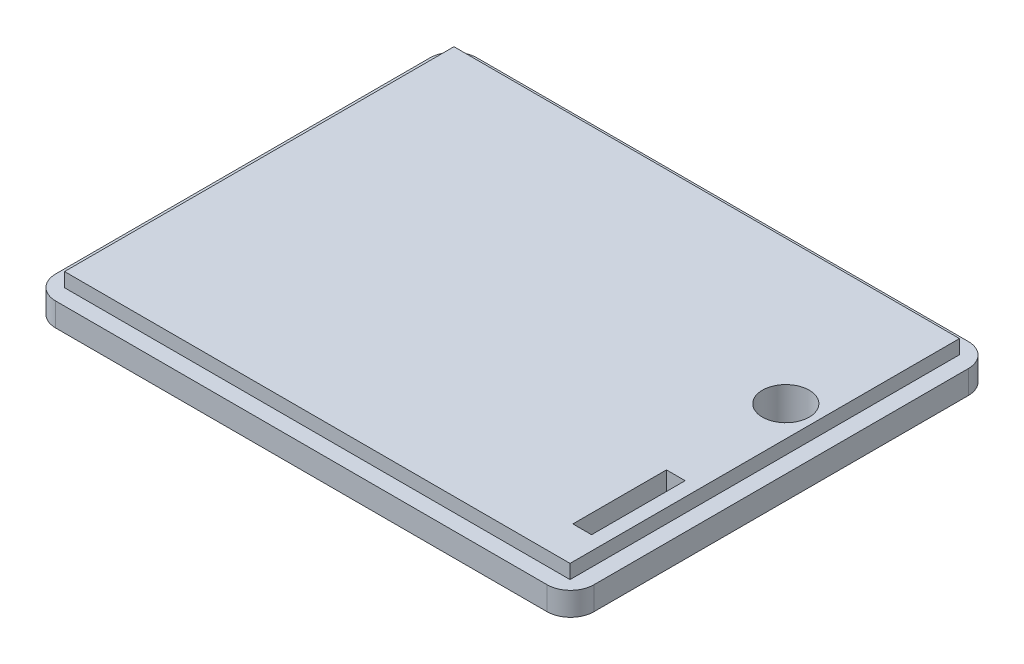
ISO-10303-21;
HEADER;
FILE_DESCRIPTION(('STEP AP214'),'2;1');
FILE_NAME('part.step','',(''),(''),'','','');
FILE_SCHEMA(('AUTOMOTIVE_DESIGN { 1 0 10303 214 1 1 1 1 }'));
ENDSEC;
DATA;
#1=APPLICATION_CONTEXT('core data for automotive mechanical design processes');
#2=APPLICATION_PROTOCOL_DEFINITION('international standard','automotive_design',2000,#1);
#3=PRODUCT_CONTEXT('',#1,'mechanical');
#4=PRODUCT('Part','Part','',(#3));
#5=PRODUCT_RELATED_PRODUCT_CATEGORY('part','',(#4));
#6=PRODUCT_DEFINITION_FORMATION('','',#4);
#7=PRODUCT_DEFINITION_CONTEXT('part definition',#1,'design');
#8=PRODUCT_DEFINITION('design','',#6,#7);
#9=PRODUCT_DEFINITION_SHAPE('','',#8);
#10=(LENGTH_UNIT() NAMED_UNIT(*) SI_UNIT(.MILLI.,.METRE.));
#11=(NAMED_UNIT(*) PLANE_ANGLE_UNIT() SI_UNIT($,.RADIAN.));
#12=(NAMED_UNIT(*) SI_UNIT($,.STERADIAN.) SOLID_ANGLE_UNIT());
#13=UNCERTAINTY_MEASURE_WITH_UNIT(LENGTH_MEASURE(1.E-05),#10,'distance_accuracy_value','');
#14=(GEOMETRIC_REPRESENTATION_CONTEXT(3) GLOBAL_UNCERTAINTY_ASSIGNED_CONTEXT((#13)) GLOBAL_UNIT_ASSIGNED_CONTEXT((#10,
#11,#12)) REPRESENTATION_CONTEXT('',''));
#15=CARTESIAN_POINT('',(0.,0.,0.));
#16=DIRECTION('',(0.,0.,1.));
#17=DIRECTION('',(1.,0.,0.));
#18=AXIS2_PLACEMENT_3D('',#15,#16,#17);
#19=CARTESIAN_POINT('',(57.5,5.,-45.));
#20=DIRECTION('',(-1.,0.,0.));
#21=DIRECTION('',(0.,0.,1.));
#22=AXIS2_PLACEMENT_3D('',#19,#20,#21);
#23=PLANE('',#22);
#24=DIRECTION('',(0.,0.,-1.));
#25=VECTOR('',#24,1.);
#26=CARTESIAN_POINT('',(57.5,0.,-45.));
#27=LINE('',#26,#25);
#28=CARTESIAN_POINT('',(57.5,0.,40.));
#29=VERTEX_POINT('',#28);
#30=CARTESIAN_POINT('',(57.5,0.,-40.));
#31=VERTEX_POINT('',#30);
#32=EDGE_CURVE('E326',#29,#31,#27,.T.);
#33=ORIENTED_EDGE('',*,*,#32,.T.);
#34=DIRECTION('',(0.,-1.,0.));
#35=VECTOR('',#34,1.);
#36=CARTESIAN_POINT('',(57.5,5.,-40.));
#37=LINE('',#36,#35);
#38=CARTESIAN_POINT('',(57.5,5.,-40.));
#39=VERTEX_POINT('',#38);
#40=EDGE_CURVE('E378',#31,#39,#37,.F.);
#41=ORIENTED_EDGE('',*,*,#40,.T.);
#42=DIRECTION('',(0.,0.,-1.));
#43=VECTOR('',#42,1.);
#44=CARTESIAN_POINT('',(57.5,5.,-45.));
#45=LINE('',#44,#43);
#46=CARTESIAN_POINT('',(57.5,5.,40.));
#47=VERTEX_POINT('',#46);
#48=EDGE_CURVE('E327',#47,#39,#45,.T.);
#49=ORIENTED_EDGE('',*,*,#48,.F.);
#50=DIRECTION('',(0.,-1.,0.));
#51=VECTOR('',#50,1.);
#52=CARTESIAN_POINT('',(57.5,5.,40.));
#53=LINE('',#52,#51);
#54=EDGE_CURVE('E375',#47,#29,#53,.T.);
#55=ORIENTED_EDGE('',*,*,#54,.T.);
#56=EDGE_LOOP('',(#33,#41,#49,#55));
#57=FACE_BOUND('',#56,.T.);
#58=ADVANCED_FACE('F33',(#57),#23,.F.);
#59=CARTESIAN_POINT('',(-57.5,5.,-45.));
#60=DIRECTION('',(0.,0.,1.));
#61=DIRECTION('',(1.,0.,0.));
#62=AXIS2_PLACEMENT_3D('',#59,#60,#61);
#63=PLANE('',#62);
#64=DIRECTION('',(-1.,0.,0.));
#65=VECTOR('',#64,1.);
#66=CARTESIAN_POINT('',(-57.5,0.,-45.));
#67=LINE('',#66,#65);
#68=CARTESIAN_POINT('',(52.5,0.,-45.));
#69=VERTEX_POINT('',#68);
#70=CARTESIAN_POINT('',(-52.5,0.,-45.));
#71=VERTEX_POINT('',#70);
#72=EDGE_CURVE('E342',#69,#71,#67,.T.);
#73=ORIENTED_EDGE('',*,*,#72,.T.);
#74=DIRECTION('',(0.,-1.,0.));
#75=VECTOR('',#74,1.);
#76=CARTESIAN_POINT('',(-52.5,5.,-45.));
#77=LINE('',#76,#75);
#78=CARTESIAN_POINT('',(-52.5,5.,-45.));
#79=VERTEX_POINT('',#78);
#80=EDGE_CURVE('E365',#71,#79,#77,.F.);
#81=ORIENTED_EDGE('',*,*,#80,.T.);
#82=DIRECTION('',(-1.,0.,0.));
#83=VECTOR('',#82,1.);
#84=CARTESIAN_POINT('',(-57.5,5.,-45.));
#85=LINE('',#84,#83);
#86=CARTESIAN_POINT('',(52.5,5.,-45.));
#87=VERTEX_POINT('',#86);
#88=EDGE_CURVE('E330',#87,#79,#85,.T.);
#89=ORIENTED_EDGE('',*,*,#88,.F.);
#90=DIRECTION('',(0.,-1.,0.));
#91=VECTOR('',#90,1.);
#92=CARTESIAN_POINT('',(52.5,5.,-45.));
#93=LINE('',#92,#91);
#94=EDGE_CURVE('E362',#87,#69,#93,.T.);
#95=ORIENTED_EDGE('',*,*,#94,.T.);
#96=EDGE_LOOP('',(#73,#81,#89,#95));
#97=FACE_BOUND('',#96,.T.);
#98=ADVANCED_FACE('F230',(#97),#63,.F.);
#99=CARTESIAN_POINT('',(-57.5,5.,-45.));
#100=DIRECTION('',(1.,0.,0.));
#101=DIRECTION('',(0.,0.,-1.));
#102=AXIS2_PLACEMENT_3D('',#99,#100,#101);
#103=PLANE('',#102);
#104=DIRECTION('',(0.,0.,1.));
#105=VECTOR('',#104,1.);
#106=CARTESIAN_POINT('',(-57.5,5.,-45.));
#107=LINE('',#106,#105);
#108=CARTESIAN_POINT('',(-57.5,5.,-40.));
#109=VERTEX_POINT('',#108);
#110=CARTESIAN_POINT('',(-57.5,5.,40.));
#111=VERTEX_POINT('',#110);
#112=EDGE_CURVE('E334',#109,#111,#107,.T.);
#113=ORIENTED_EDGE('',*,*,#112,.F.);
#114=DIRECTION('',(0.,-1.,0.));
#115=VECTOR('',#114,1.);
#116=CARTESIAN_POINT('',(-57.5,5.,-40.));
#117=LINE('',#116,#115);
#118=CARTESIAN_POINT('',(-57.5,0.,-40.));
#119=VERTEX_POINT('',#118);
#120=EDGE_CURVE('E351',#109,#119,#117,.T.);
#121=ORIENTED_EDGE('',*,*,#120,.T.);
#122=DIRECTION('',(0.,0.,1.));
#123=VECTOR('',#122,1.);
#124=CARTESIAN_POINT('',(-57.5,0.,-45.));
#125=LINE('',#124,#123);
#126=CARTESIAN_POINT('',(-57.5,0.,40.));
#127=VERTEX_POINT('',#126);
#128=EDGE_CURVE('E345',#119,#127,#125,.T.);
#129=ORIENTED_EDGE('',*,*,#128,.T.);
#130=DIRECTION('',(0.,-1.,0.));
#131=VECTOR('',#130,1.);
#132=CARTESIAN_POINT('',(-57.5,5.,40.));
#133=LINE('',#132,#131);
#134=EDGE_CURVE('E340',#127,#111,#133,.F.);
#135=ORIENTED_EDGE('',*,*,#134,.T.);
#136=EDGE_LOOP('',(#113,#121,#129,#135));
#137=FACE_BOUND('',#136,.T.);
#138=ADVANCED_FACE('F236',(#137),#103,.F.);
#139=CARTESIAN_POINT('',(-57.5,5.,45.));
#140=DIRECTION('',(0.,0.,-1.));
#141=DIRECTION('',(-1.,0.,0.));
#142=AXIS2_PLACEMENT_3D('',#139,#140,#141);
#143=PLANE('',#142);
#144=DIRECTION('',(1.,0.,0.));
#145=VECTOR('',#144,1.);
#146=CARTESIAN_POINT('',(-57.5,0.,45.));
#147=LINE('',#146,#145);
#148=CARTESIAN_POINT('',(-52.5,0.,45.));
#149=VERTEX_POINT('',#148);
#150=CARTESIAN_POINT('',(52.5,0.,45.));
#151=VERTEX_POINT('',#150);
#152=EDGE_CURVE('E331',#149,#151,#147,.T.);
#153=ORIENTED_EDGE('',*,*,#152,.T.);
#154=DIRECTION('',(0.,-1.,0.));
#155=VECTOR('',#154,1.);
#156=CARTESIAN_POINT('',(52.5,5.,45.));
#157=LINE('',#156,#155);
#158=CARTESIAN_POINT('',(52.5,5.,45.));
#159=VERTEX_POINT('',#158);
#160=EDGE_CURVE('E173',#151,#159,#157,.F.);
#161=ORIENTED_EDGE('',*,*,#160,.T.);
#162=DIRECTION('',(1.,0.,0.));
#163=VECTOR('',#162,1.);
#164=CARTESIAN_POINT('',(-57.5,5.,45.));
#165=LINE('',#164,#163);
#166=CARTESIAN_POINT('',(-52.5,5.,45.));
#167=VERTEX_POINT('',#166);
#168=EDGE_CURVE('E337',#167,#159,#165,.T.);
#169=ORIENTED_EDGE('',*,*,#168,.F.);
#170=DIRECTION('',(0.,-1.,0.));
#171=VECTOR('',#170,1.);
#172=CARTESIAN_POINT('',(-52.5,5.,45.));
#173=LINE('',#172,#171);
#174=EDGE_CURVE('E380',#167,#149,#173,.T.);
#175=ORIENTED_EDGE('',*,*,#174,.T.);
#176=EDGE_LOOP('',(#153,#161,#169,#175));
#177=FACE_BOUND('',#176,.T.);
#178=ADVANCED_FACE('F386',(#177),#143,.F.);
#179=CARTESIAN_POINT('',(0.,5.,0.));
#180=DIRECTION('',(0.,1.,0.));
#181=DIRECTION('',(0.,0.,1.));
#182=AXIS2_PLACEMENT_3D('',#179,#180,#181);
#183=PLANE('',#182);
#184=DIRECTION('',(0.,0.,-1.));
#185=VECTOR('',#184,1.);
#186=CARTESIAN_POINT('',(54.,5.,-41.6));
#187=LINE('',#186,#185);
#188=CARTESIAN_POINT('',(54.,5.,41.6));
#189=VERTEX_POINT('',#188);
#190=CARTESIAN_POINT('',(54.,5.,-41.6));
#191=VERTEX_POINT('',#190);
#192=EDGE_CURVE('E304',#189,#191,#187,.T.);
#193=ORIENTED_EDGE('',*,*,#192,.F.);
#194=DIRECTION('',(1.,0.,0.));
#195=VECTOR('',#194,1.);
#196=CARTESIAN_POINT('',(-54.,5.,41.6));
#197=LINE('',#196,#195);
#198=CARTESIAN_POINT('',(-54.,5.,41.6));
#199=VERTEX_POINT('',#198);
#200=EDGE_CURVE('E297',#199,#189,#197,.T.);
#201=ORIENTED_EDGE('',*,*,#200,.F.);
#202=DIRECTION('',(0.,0.,1.));
#203=VECTOR('',#202,1.);
#204=CARTESIAN_POINT('',(-54.,5.,-41.6));
#205=LINE('',#204,#203);
#206=CARTESIAN_POINT('',(-54.,5.,-41.6));
#207=VERTEX_POINT('',#206);
#208=EDGE_CURVE('E310',#207,#199,#205,.T.);
#209=ORIENTED_EDGE('',*,*,#208,.F.);
#210=DIRECTION('',(-1.,0.,0.));
#211=VECTOR('',#210,1.);
#212=CARTESIAN_POINT('',(-54.,5.,-41.6));
#213=LINE('',#212,#211);
#214=EDGE_CURVE('E307',#191,#207,#213,.T.);
#215=ORIENTED_EDGE('',*,*,#214,.F.);
#216=EDGE_LOOP('',(#193,#201,#209,#215));
#217=FACE_BOUND('',#216,.T.);
#218=ORIENTED_EDGE('',*,*,#88,.T.);
#219=CARTESIAN_POINT('',(-52.5,5.,-40.));
#220=DIRECTION('',(0.,1.,0.));
#221=DIRECTION('',(0.,0.,1.));
#222=AXIS2_PLACEMENT_3D('',#219,#220,#221);
#223=CIRCLE('',#222,5.);
#224=EDGE_CURVE('E373',#79,#109,#223,.T.);
#225=ORIENTED_EDGE('',*,*,#224,.T.);
#226=ORIENTED_EDGE('',*,*,#112,.T.);
#227=CARTESIAN_POINT('',(-52.5,5.,40.));
#228=DIRECTION('',(0.,1.,0.));
#229=DIRECTION('',(0.,0.,1.));
#230=AXIS2_PLACEMENT_3D('',#227,#228,#229);
#231=CIRCLE('',#230,5.);
#232=EDGE_CURVE('E367',#111,#167,#231,.T.);
#233=ORIENTED_EDGE('',*,*,#232,.T.);
#234=ORIENTED_EDGE('',*,*,#168,.T.);
#235=CARTESIAN_POINT('',(52.5,5.,40.));
#236=DIRECTION('',(0.,1.,0.));
#237=DIRECTION('',(0.,0.,1.));
#238=AXIS2_PLACEMENT_3D('',#235,#236,#237);
#239=CIRCLE('',#238,5.);
#240=EDGE_CURVE('E369',#159,#47,#239,.T.);
#241=ORIENTED_EDGE('',*,*,#240,.T.);
#242=ORIENTED_EDGE('',*,*,#48,.T.);
#243=CARTESIAN_POINT('',(52.5,5.,-40.));
#244=DIRECTION('',(0.,1.,0.));
#245=DIRECTION('',(0.,0.,1.));
#246=AXIS2_PLACEMENT_3D('',#243,#244,#245);
#247=CIRCLE('',#246,5.);
#248=EDGE_CURVE('E371',#39,#87,#247,.T.);
#249=ORIENTED_EDGE('',*,*,#248,.T.);
#250=EDGE_LOOP('',(#218,#225,#226,#233,#234,#241,#242,#249));
#251=FACE_BOUND('',#250,.T.);
#252=ADVANCED_FACE('F391',(#217,#251),#183,.T.);
#253=CARTESIAN_POINT('',(0.,0.,0.));
#254=DIRECTION('',(0.,1.,0.));
#255=DIRECTION('',(0.,0.,1.));
#256=AXIS2_PLACEMENT_3D('',#253,#254,#255);
#257=PLANE('',#256);
#258=CARTESIAN_POINT('',(47.5,0.,-11.));
#259=DIRECTION('',(0.,1.,0.));
#260=DIRECTION('',(0.,0.,1.));
#261=AXIS2_PLACEMENT_3D('',#258,#259,#260);
#262=CIRCLE('',#261,6.);
#263=CARTESIAN_POINT('',(47.5,0.,-5.00000000000001));
#264=VERTEX_POINT('',#263);
#265=EDGE_CURVE('E11',#264,#264,#262,.T.);
#266=ORIENTED_EDGE('',*,*,#265,.T.);
#267=EDGE_LOOP('',(#266));
#268=FACE_BOUND('',#267,.T.);
#269=DIRECTION('',(0.,0.,1.));
#270=VECTOR('',#269,1.);
#271=CARTESIAN_POINT('',(52.,0.,0.));
#272=LINE('',#271,#270);
#273=CARTESIAN_POINT('',(52.,0.,35.));
#274=VERTEX_POINT('',#273);
#275=CARTESIAN_POINT('',(52.,0.,13.));
#276=VERTEX_POINT('',#275);
#277=EDGE_CURVE('E196',#274,#276,#272,.F.);
#278=ORIENTED_EDGE('',*,*,#277,.T.);
#279=DIRECTION('',(1.,0.,0.));
#280=VECTOR('',#279,1.);
#281=CARTESIAN_POINT('',(0.,0.,12.9999999999999));
#282=LINE('',#281,#280);
#283=CARTESIAN_POINT('',(46.,0.,13.));
#284=VERTEX_POINT('',#283);
#285=EDGE_CURVE('E198',#276,#284,#282,.F.);
#286=ORIENTED_EDGE('',*,*,#285,.T.);
#287=DIRECTION('',(0.,0.,-1.));
#288=VECTOR('',#287,1.);
#289=CARTESIAN_POINT('',(46.,0.,0.));
#290=LINE('',#289,#288);
#291=CARTESIAN_POINT('',(46.,0.,35.));
#292=VERTEX_POINT('',#291);
#293=EDGE_CURVE('E194',#284,#292,#290,.F.);
#294=ORIENTED_EDGE('',*,*,#293,.T.);
#295=DIRECTION('',(-1.,0.,0.));
#296=VECTOR('',#295,1.);
#297=CARTESIAN_POINT('',(0.,0.,35.));
#298=LINE('',#297,#296);
#299=EDGE_CURVE('E188',#292,#274,#298,.F.);
#300=ORIENTED_EDGE('',*,*,#299,.T.);
#301=EDGE_LOOP('',(#278,#286,#294,#300));
#302=FACE_BOUND('',#301,.T.);
#303=ORIENTED_EDGE('',*,*,#128,.F.);
#304=CARTESIAN_POINT('',(-52.5,0.,-40.));
#305=DIRECTION('',(0.,1.,0.));
#306=DIRECTION('',(0.,0.,1.));
#307=AXIS2_PLACEMENT_3D('',#304,#305,#306);
#308=CIRCLE('',#307,5.);
#309=EDGE_CURVE('E360',#119,#71,#308,.F.);
#310=ORIENTED_EDGE('',*,*,#309,.T.);
#311=ORIENTED_EDGE('',*,*,#72,.F.);
#312=CARTESIAN_POINT('',(52.5,0.,-40.));
#313=DIRECTION('',(0.,1.,0.));
#314=DIRECTION('',(0.,0.,1.));
#315=AXIS2_PLACEMENT_3D('',#312,#313,#314);
#316=CIRCLE('',#315,5.);
#317=EDGE_CURVE('E358',#69,#31,#316,.F.);
#318=ORIENTED_EDGE('',*,*,#317,.T.);
#319=ORIENTED_EDGE('',*,*,#32,.F.);
#320=CARTESIAN_POINT('',(52.5,0.,40.));
#321=DIRECTION('',(0.,1.,0.));
#322=DIRECTION('',(0.,0.,1.));
#323=AXIS2_PLACEMENT_3D('',#320,#321,#322);
#324=CIRCLE('',#323,5.);
#325=EDGE_CURVE('E356',#29,#151,#324,.F.);
#326=ORIENTED_EDGE('',*,*,#325,.T.);
#327=ORIENTED_EDGE('',*,*,#152,.F.);
#328=CARTESIAN_POINT('',(-52.5,0.,40.));
#329=DIRECTION('',(0.,1.,0.));
#330=DIRECTION('',(0.,0.,1.));
#331=AXIS2_PLACEMENT_3D('',#328,#329,#330);
#332=CIRCLE('',#331,5.);
#333=EDGE_CURVE('E354',#149,#127,#332,.F.);
#334=ORIENTED_EDGE('',*,*,#333,.T.);
#335=EDGE_LOOP('',(#303,#310,#311,#318,#319,#326,#327,#334));
#336=FACE_BOUND('',#335,.T.);
#337=ADVANCED_FACE('F283',(#268,#302,#336),#257,.F.);
#338=CARTESIAN_POINT('',(54.,8.,-41.6));
#339=DIRECTION('',(-1.,0.,0.));
#340=DIRECTION('',(0.,0.,1.));
#341=AXIS2_PLACEMENT_3D('',#338,#339,#340);
#342=PLANE('',#341);
#343=ORIENTED_EDGE('',*,*,#192,.T.);
#344=DIRECTION('',(0.,-1.,0.));
#345=VECTOR('',#344,1.);
#346=CARTESIAN_POINT('',(54.,8.,-41.6));
#347=LINE('',#346,#345);
#348=CARTESIAN_POINT('',(54.,8.,-41.6));
#349=VERTEX_POINT('',#348);
#350=EDGE_CURVE('E323',#349,#191,#347,.T.);
#351=ORIENTED_EDGE('',*,*,#350,.F.);
#352=DIRECTION('',(0.,0.,-1.));
#353=VECTOR('',#352,1.);
#354=CARTESIAN_POINT('',(54.,8.,-41.6));
#355=LINE('',#354,#353);
#356=CARTESIAN_POINT('',(54.,8.,41.6));
#357=VERTEX_POINT('',#356);
#358=EDGE_CURVE('E293',#357,#349,#355,.T.);
#359=ORIENTED_EDGE('',*,*,#358,.F.);
#360=DIRECTION('',(0.,-1.,0.));
#361=VECTOR('',#360,1.);
#362=CARTESIAN_POINT('',(54.,8.,41.6));
#363=LINE('',#362,#361);
#364=EDGE_CURVE('E303',#357,#189,#363,.T.);
#365=ORIENTED_EDGE('',*,*,#364,.T.);
#366=EDGE_LOOP('',(#343,#351,#359,#365));
#367=FACE_BOUND('',#366,.T.);
#368=ADVANCED_FACE('F416',(#367),#342,.F.);
#369=CARTESIAN_POINT('',(-54.,8.,-41.6));
#370=DIRECTION('',(0.,0.,1.));
#371=DIRECTION('',(1.,0.,0.));
#372=AXIS2_PLACEMENT_3D('',#369,#370,#371);
#373=PLANE('',#372);
#374=ORIENTED_EDGE('',*,*,#214,.T.);
#375=DIRECTION('',(0.,-1.,0.));
#376=VECTOR('',#375,1.);
#377=CARTESIAN_POINT('',(-54.,8.,-41.6));
#378=LINE('',#377,#376);
#379=CARTESIAN_POINT('',(-54.,8.,-41.6));
#380=VERTEX_POINT('',#379);
#381=EDGE_CURVE('E320',#380,#207,#378,.T.);
#382=ORIENTED_EDGE('',*,*,#381,.F.);
#383=DIRECTION('',(-1.,0.,0.));
#384=VECTOR('',#383,1.);
#385=CARTESIAN_POINT('',(-54.,8.,-41.6));
#386=LINE('',#385,#384);
#387=EDGE_CURVE('E296',#349,#380,#386,.T.);
#388=ORIENTED_EDGE('',*,*,#387,.F.);
#389=ORIENTED_EDGE('',*,*,#350,.T.);
#390=EDGE_LOOP('',(#374,#382,#388,#389));
#391=FACE_BOUND('',#390,.T.);
#392=ADVANCED_FACE('F423',(#391),#373,.F.);
#393=CARTESIAN_POINT('',(-54.,8.,-41.6));
#394=DIRECTION('',(1.,0.,0.));
#395=DIRECTION('',(0.,0.,-1.));
#396=AXIS2_PLACEMENT_3D('',#393,#394,#395);
#397=PLANE('',#396);
#398=ORIENTED_EDGE('',*,*,#208,.T.);
#399=DIRECTION('',(0.,-1.,0.));
#400=VECTOR('',#399,1.);
#401=CARTESIAN_POINT('',(-54.,8.,41.6));
#402=LINE('',#401,#400);
#403=CARTESIAN_POINT('',(-54.,8.,41.6));
#404=VERTEX_POINT('',#403);
#405=EDGE_CURVE('E317',#404,#199,#402,.T.);
#406=ORIENTED_EDGE('',*,*,#405,.F.);
#407=DIRECTION('',(0.,0.,1.));
#408=VECTOR('',#407,1.);
#409=CARTESIAN_POINT('',(-54.,8.,-41.6));
#410=LINE('',#409,#408);
#411=EDGE_CURVE('E299',#380,#404,#410,.T.);
#412=ORIENTED_EDGE('',*,*,#411,.F.);
#413=ORIENTED_EDGE('',*,*,#381,.T.);
#414=EDGE_LOOP('',(#398,#406,#412,#413));
#415=FACE_BOUND('',#414,.T.);
#416=ADVANCED_FACE('F427',(#415),#397,.F.);
#417=CARTESIAN_POINT('',(-54.,8.,41.6));
#418=DIRECTION('',(0.,0.,-1.));
#419=DIRECTION('',(-1.,0.,0.));
#420=AXIS2_PLACEMENT_3D('',#417,#418,#419);
#421=PLANE('',#420);
#422=ORIENTED_EDGE('',*,*,#200,.T.);
#423=ORIENTED_EDGE('',*,*,#364,.F.);
#424=DIRECTION('',(1.,0.,0.));
#425=VECTOR('',#424,1.);
#426=CARTESIAN_POINT('',(-54.,8.,41.6));
#427=LINE('',#426,#425);
#428=EDGE_CURVE('E301',#404,#357,#427,.T.);
#429=ORIENTED_EDGE('',*,*,#428,.F.);
#430=ORIENTED_EDGE('',*,*,#405,.T.);
#431=EDGE_LOOP('',(#422,#423,#429,#430));
#432=FACE_BOUND('',#431,.T.);
#433=ADVANCED_FACE('F431',(#432),#421,.F.);
#434=CARTESIAN_POINT('',(0.,8.,0.));
#435=DIRECTION('',(0.,1.,0.));
#436=DIRECTION('',(0.,0.,1.));
#437=AXIS2_PLACEMENT_3D('',#434,#435,#436);
#438=PLANE('',#437);
#439=CARTESIAN_POINT('',(47.5,8.,-11.));
#440=DIRECTION('',(0.,1.,0.));
#441=DIRECTION('',(0.,0.,1.));
#442=AXIS2_PLACEMENT_3D('',#439,#440,#441);
#443=CIRCLE('',#442,5.);
#444=CARTESIAN_POINT('',(47.5,8.,-6.00000000000001));
#445=VERTEX_POINT('',#444);
#446=EDGE_CURVE('E207',#445,#445,#443,.T.);
#447=ORIENTED_EDGE('',*,*,#446,.F.);
#448=EDGE_LOOP('',(#447));
#449=FACE_BOUND('',#448,.T.);
#450=DIRECTION('',(0.,0.,1.));
#451=VECTOR('',#450,1.);
#452=CARTESIAN_POINT('',(47.,8.,0.));
#453=LINE('',#452,#451);
#454=CARTESIAN_POINT('',(47.,8.,14.));
#455=VERTEX_POINT('',#454);
#456=CARTESIAN_POINT('',(47.,8.,34.));
#457=VERTEX_POINT('',#456);
#458=EDGE_CURVE('E177',#455,#457,#453,.T.);
#459=ORIENTED_EDGE('',*,*,#458,.F.);
#460=DIRECTION('',(-1.,0.,0.));
#461=VECTOR('',#460,1.);
#462=CARTESIAN_POINT('',(0.,8.,13.9999999999999));
#463=LINE('',#462,#461);
#464=CARTESIAN_POINT('',(51.,8.,14.));
#465=VERTEX_POINT('',#464);
#466=EDGE_CURVE('E161',#465,#455,#463,.T.);
#467=ORIENTED_EDGE('',*,*,#466,.F.);
#468=DIRECTION('',(0.,0.,-1.));
#469=VECTOR('',#468,1.);
#470=CARTESIAN_POINT('',(51.,8.,0.));
#471=LINE('',#470,#469);
#472=CARTESIAN_POINT('',(51.,8.,34.));
#473=VERTEX_POINT('',#472);
#474=EDGE_CURVE('E172',#473,#465,#471,.T.);
#475=ORIENTED_EDGE('',*,*,#474,.F.);
#476=DIRECTION('',(1.,0.,0.));
#477=VECTOR('',#476,1.);
#478=CARTESIAN_POINT('',(0.,8.,34.));
#479=LINE('',#478,#477);
#480=EDGE_CURVE('E185',#457,#473,#479,.T.);
#481=ORIENTED_EDGE('',*,*,#480,.F.);
#482=EDGE_LOOP('',(#459,#467,#475,#481));
#483=FACE_BOUND('',#482,.T.);
#484=ORIENTED_EDGE('',*,*,#358,.T.);
#485=ORIENTED_EDGE('',*,*,#387,.T.);
#486=ORIENTED_EDGE('',*,*,#411,.T.);
#487=ORIENTED_EDGE('',*,*,#428,.T.);
#488=EDGE_LOOP('',(#484,#485,#486,#487));
#489=FACE_BOUND('',#488,.T.);
#490=ADVANCED_FACE('F183',(#449,#483,#489),#438,.T.);
#491=CARTESIAN_POINT('',(-52.5,5.,-40.));
#492=DIRECTION('',(0.,-1.,0.));
#493=DIRECTION('',(0.,0.,-1.));
#494=AXIS2_PLACEMENT_3D('',#491,#492,#493);
#495=CYLINDRICAL_SURFACE('',#494,5.);
#496=ORIENTED_EDGE('',*,*,#224,.F.);
#497=ORIENTED_EDGE('',*,*,#80,.F.);
#498=ORIENTED_EDGE('',*,*,#309,.F.);
#499=ORIENTED_EDGE('',*,*,#120,.F.);
#500=EDGE_LOOP('',(#496,#497,#498,#499));
#501=FACE_BOUND('',#500,.T.);
#502=ADVANCED_FACE('F242',(#501),#495,.T.);
#503=CARTESIAN_POINT('',(52.5,5.,-40.));
#504=DIRECTION('',(0.,-1.,0.));
#505=DIRECTION('',(0.,0.,-1.));
#506=AXIS2_PLACEMENT_3D('',#503,#504,#505);
#507=CYLINDRICAL_SURFACE('',#506,5.);
#508=ORIENTED_EDGE('',*,*,#248,.F.);
#509=ORIENTED_EDGE('',*,*,#40,.F.);
#510=ORIENTED_EDGE('',*,*,#317,.F.);
#511=ORIENTED_EDGE('',*,*,#94,.F.);
#512=EDGE_LOOP('',(#508,#509,#510,#511));
#513=FACE_BOUND('',#512,.T.);
#514=ADVANCED_FACE('F245',(#513),#507,.T.);
#515=CARTESIAN_POINT('',(52.5,5.,40.));
#516=DIRECTION('',(0.,-1.,0.));
#517=DIRECTION('',(0.,0.,-1.));
#518=AXIS2_PLACEMENT_3D('',#515,#516,#517);
#519=CYLINDRICAL_SURFACE('',#518,5.);
#520=ORIENTED_EDGE('',*,*,#240,.F.);
#521=ORIENTED_EDGE('',*,*,#160,.F.);
#522=ORIENTED_EDGE('',*,*,#325,.F.);
#523=ORIENTED_EDGE('',*,*,#54,.F.);
#524=EDGE_LOOP('',(#520,#521,#522,#523));
#525=FACE_BOUND('',#524,.T.);
#526=ADVANCED_FACE('F249',(#525),#519,.T.);
#527=CARTESIAN_POINT('',(-52.5,5.,40.));
#528=DIRECTION('',(0.,-1.,0.));
#529=DIRECTION('',(0.,0.,-1.));
#530=AXIS2_PLACEMENT_3D('',#527,#528,#529);
#531=CYLINDRICAL_SURFACE('',#530,5.);
#532=ORIENTED_EDGE('',*,*,#232,.F.);
#533=ORIENTED_EDGE('',*,*,#134,.F.);
#534=ORIENTED_EDGE('',*,*,#333,.F.);
#535=ORIENTED_EDGE('',*,*,#174,.F.);
#536=EDGE_LOOP('',(#532,#533,#534,#535));
#537=FACE_BOUND('',#536,.T.);
#538=ADVANCED_FACE('F253',(#537),#531,.T.);
#539=CARTESIAN_POINT('',(47.,10.,34.));
#540=DIRECTION('',(-1.,0.,0.));
#541=DIRECTION('',(0.,0.,1.));
#542=AXIS2_PLACEMENT_3D('',#539,#540,#541);
#543=PLANE('',#542);
#544=DIRECTION('',(0.,-1.,0.));
#545=VECTOR('',#544,1.);
#546=CARTESIAN_POINT('',(47.,10.,34.));
#547=LINE('',#546,#545);
#548=CARTESIAN_POINT('',(47.,0.999999999999999,34.));
#549=VERTEX_POINT('',#548);
#550=EDGE_CURVE('E289',#457,#549,#547,.T.);
#551=ORIENTED_EDGE('',*,*,#550,.T.);
#552=DIRECTION('',(0.,0.,-1.));
#553=VECTOR('',#552,1.);
#554=CARTESIAN_POINT('',(47.,0.999999999999999,34.));
#555=LINE('',#554,#553);
#556=CARTESIAN_POINT('',(47.,0.999999999999999,14.));
#557=VERTEX_POINT('',#556);
#558=EDGE_CURVE('E179',#549,#557,#555,.T.);
#559=ORIENTED_EDGE('',*,*,#558,.T.);
#560=DIRECTION('',(0.,-1.,0.));
#561=VECTOR('',#560,1.);
#562=CARTESIAN_POINT('',(47.,10.,14.));
#563=LINE('',#562,#561);
#564=EDGE_CURVE('E165',#455,#557,#563,.T.);
#565=ORIENTED_EDGE('',*,*,#564,.F.);
#566=ORIENTED_EDGE('',*,*,#458,.T.);
#567=EDGE_LOOP('',(#551,#559,#565,#566));
#568=FACE_BOUND('',#567,.T.);
#569=ADVANCED_FACE('F176',(#568),#543,.F.);
#570=CARTESIAN_POINT('',(47.,10.,34.));
#571=DIRECTION('',(0.,0.,1.));
#572=DIRECTION('',(1.,0.,0.));
#573=AXIS2_PLACEMENT_3D('',#570,#571,#572);
#574=PLANE('',#573);
#575=DIRECTION('',(0.,-1.,0.));
#576=VECTOR('',#575,1.);
#577=CARTESIAN_POINT('',(51.,10.,34.));
#578=LINE('',#577,#576);
#579=CARTESIAN_POINT('',(51.,0.999999999999999,34.));
#580=VERTEX_POINT('',#579);
#581=EDGE_CURVE('E287',#473,#580,#578,.T.);
#582=ORIENTED_EDGE('',*,*,#581,.T.);
#583=DIRECTION('',(-1.,0.,0.));
#584=VECTOR('',#583,1.);
#585=CARTESIAN_POINT('',(47.,0.999999999999999,34.));
#586=LINE('',#585,#584);
#587=EDGE_CURVE('E48',#580,#549,#586,.T.);
#588=ORIENTED_EDGE('',*,*,#587,.T.);
#589=ORIENTED_EDGE('',*,*,#550,.F.);
#590=ORIENTED_EDGE('',*,*,#480,.T.);
#591=EDGE_LOOP('',(#582,#588,#589,#590));
#592=FACE_BOUND('',#591,.T.);
#593=ADVANCED_FACE('F440',(#592),#574,.F.);
#594=CARTESIAN_POINT('',(51.,10.,34.));
#595=DIRECTION('',(1.,0.,0.));
#596=DIRECTION('',(0.,0.,-1.));
#597=AXIS2_PLACEMENT_3D('',#594,#595,#596);
#598=PLANE('',#597);
#599=DIRECTION('',(0.,-1.,0.));
#600=VECTOR('',#599,1.);
#601=CARTESIAN_POINT('',(51.,10.,14.));
#602=LINE('',#601,#600);
#603=CARTESIAN_POINT('',(51.,0.999999999999999,14.));
#604=VERTEX_POINT('',#603);
#605=EDGE_CURVE('E167',#465,#604,#602,.T.);
#606=ORIENTED_EDGE('',*,*,#605,.T.);
#607=DIRECTION('',(0.,0.,1.));
#608=VECTOR('',#607,1.);
#609=CARTESIAN_POINT('',(51.,0.999999999999999,34.));
#610=LINE('',#609,#608);
#611=EDGE_CURVE('E56',#604,#580,#610,.T.);
#612=ORIENTED_EDGE('',*,*,#611,.T.);
#613=ORIENTED_EDGE('',*,*,#581,.F.);
#614=ORIENTED_EDGE('',*,*,#474,.T.);
#615=EDGE_LOOP('',(#606,#612,#613,#614));
#616=FACE_BOUND('',#615,.T.);
#617=ADVANCED_FACE('F274',(#616),#598,.F.);
#618=CARTESIAN_POINT('',(47.,10.,14.));
#619=DIRECTION('',(0.,0.,-1.));
#620=DIRECTION('',(-1.,0.,0.));
#621=AXIS2_PLACEMENT_3D('',#618,#619,#620);
#622=PLANE('',#621);
#623=ORIENTED_EDGE('',*,*,#564,.T.);
#624=DIRECTION('',(1.,0.,0.));
#625=VECTOR('',#624,1.);
#626=CARTESIAN_POINT('',(47.,0.999999999999999,14.));
#627=LINE('',#626,#625);
#628=EDGE_CURVE('E186',#557,#604,#627,.T.);
#629=ORIENTED_EDGE('',*,*,#628,.T.);
#630=ORIENTED_EDGE('',*,*,#605,.F.);
#631=ORIENTED_EDGE('',*,*,#466,.T.);
#632=EDGE_LOOP('',(#623,#629,#630,#631));
#633=FACE_BOUND('',#632,.T.);
#634=ADVANCED_FACE('F163',(#633),#622,.F.);
#635=CARTESIAN_POINT('',(47.,0.999999999999999,35.));
#636=DIRECTION('',(-1.,0.,0.));
#637=DIRECTION('',(0.,0.,1.));
#638=AXIS2_PLACEMENT_3D('',#635,#636,#637);
#639=CYLINDRICAL_SURFACE('',#638,1.);
#640=CARTESIAN_POINT('',(52.,0.999999999999999,35.));
#641=DIRECTION('',(-0.707106781186547,0.,0.707106781186547));
#642=DIRECTION('',(0.707106781186547,0.,0.707106781186547));
#643=AXIS2_PLACEMENT_3D('',#640,#641,#642);
#644=ELLIPSE('',#643,1.41421356237309,1.);
#645=EDGE_CURVE('E209',#274,#580,#644,.F.);
#646=ORIENTED_EDGE('',*,*,#645,.F.);
#647=ORIENTED_EDGE('',*,*,#299,.F.);
#648=CARTESIAN_POINT('',(46.,0.999999999999999,35.));
#649=DIRECTION('',(-0.707106781186548,0.,-0.707106781186547));
#650=DIRECTION('',(0.707106781186547,0.,-0.707106781186548));
#651=AXIS2_PLACEMENT_3D('',#648,#649,#650);
#652=ELLIPSE('',#651,1.41421356237309,1.);
#653=EDGE_CURVE('E180',#549,#292,#652,.T.);
#654=ORIENTED_EDGE('',*,*,#653,.F.);
#655=ORIENTED_EDGE('',*,*,#587,.F.);
#656=EDGE_LOOP('',(#646,#647,#654,#655));
#657=FACE_BOUND('',#656,.T.);
#658=ADVANCED_FACE('F267',(#657),#639,.T.);
#659=CARTESIAN_POINT('',(46.,0.999999999999999,34.));
#660=DIRECTION('',(0.,0.,-1.));
#661=DIRECTION('',(-1.,0.,0.));
#662=AXIS2_PLACEMENT_3D('',#659,#660,#661);
#663=CYLINDRICAL_SURFACE('',#662,1.);
#664=ORIENTED_EDGE('',*,*,#653,.T.);
#665=ORIENTED_EDGE('',*,*,#293,.F.);
#666=CARTESIAN_POINT('',(46.,0.999999999999999,13.));
#667=DIRECTION('',(0.707106781186548,0.,-0.707106781186547));
#668=DIRECTION('',(0.707106781186547,0.,0.707106781186548));
#669=AXIS2_PLACEMENT_3D('',#666,#667,#668);
#670=ELLIPSE('',#669,1.4142135623731,1.);
#671=EDGE_CURVE('E206',#557,#284,#670,.T.);
#672=ORIENTED_EDGE('',*,*,#671,.F.);
#673=ORIENTED_EDGE('',*,*,#558,.F.);
#674=EDGE_LOOP('',(#664,#665,#672,#673));
#675=FACE_BOUND('',#674,.T.);
#676=ADVANCED_FACE('F264',(#675),#663,.T.);
#677=CARTESIAN_POINT('',(52.,0.999999999999999,34.));
#678=DIRECTION('',(0.,0.,1.));
#679=DIRECTION('',(1.,0.,0.));
#680=AXIS2_PLACEMENT_3D('',#677,#678,#679);
#681=CYLINDRICAL_SURFACE('',#680,1.);
#682=ORIENTED_EDGE('',*,*,#645,.T.);
#683=ORIENTED_EDGE('',*,*,#611,.F.);
#684=CARTESIAN_POINT('',(52.,0.999999999999999,13.));
#685=DIRECTION('',(0.707106781186547,0.,0.707106781186548));
#686=DIRECTION('',(0.707106781186548,0.,-0.707106781186547));
#687=AXIS2_PLACEMENT_3D('',#684,#685,#686);
#688=ELLIPSE('',#687,1.41421356237309,1.);
#689=EDGE_CURVE('E204',#276,#604,#688,.F.);
#690=ORIENTED_EDGE('',*,*,#689,.F.);
#691=ORIENTED_EDGE('',*,*,#277,.F.);
#692=EDGE_LOOP('',(#682,#683,#690,#691));
#693=FACE_BOUND('',#692,.T.);
#694=ADVANCED_FACE('F260',(#693),#681,.T.);
#695=CARTESIAN_POINT('',(47.,0.999999999999999,13.));
#696=DIRECTION('',(1.,0.,0.));
#697=DIRECTION('',(0.,0.,-1.));
#698=AXIS2_PLACEMENT_3D('',#695,#696,#697);
#699=CYLINDRICAL_SURFACE('',#698,1.);
#700=ORIENTED_EDGE('',*,*,#671,.T.);
#701=ORIENTED_EDGE('',*,*,#285,.F.);
#702=ORIENTED_EDGE('',*,*,#689,.T.);
#703=ORIENTED_EDGE('',*,*,#628,.F.);
#704=EDGE_LOOP('',(#700,#701,#702,#703));
#705=FACE_BOUND('',#704,.T.);
#706=ADVANCED_FACE('F226',(#705),#699,.T.);
#707=CARTESIAN_POINT('',(47.5,10.,-11.));
#708=DIRECTION('',(0.,-1.,0.));
#709=DIRECTION('',(0.,0.,-1.));
#710=AXIS2_PLACEMENT_3D('',#707,#708,#709);
#711=CYLINDRICAL_SURFACE('',#710,5.);
#712=CARTESIAN_POINT('',(47.5,0.999999999999999,-11.));
#713=DIRECTION('',(0.,1.,0.));
#714=DIRECTION('',(0.,0.,1.));
#715=AXIS2_PLACEMENT_3D('',#712,#713,#714);
#716=CIRCLE('',#715,5.);
#717=CARTESIAN_POINT('',(47.5,0.999999999999999,-6.00000000000001));
#718=VERTEX_POINT('',#717);
#719=EDGE_CURVE('E41',#718,#718,#716,.F.);
#720=ORIENTED_EDGE('',*,*,#719,.T.);
#721=EDGE_LOOP('',(#720));
#722=FACE_BOUND('',#721,.T.);
#723=ORIENTED_EDGE('',*,*,#446,.T.);
#724=EDGE_LOOP('',(#723));
#725=FACE_BOUND('',#724,.T.);
#726=ADVANCED_FACE('F218',(#722,#725),#711,.F.);
#727=CARTESIAN_POINT('',(47.5,0.999999999999999,-11.));
#728=DIRECTION('',(0.,1.,0.));
#729=DIRECTION('',(0.,0.,1.));
#730=AXIS2_PLACEMENT_3D('',#727,#728,#729);
#731=TOROIDAL_SURFACE('',#730,6.,1.);
#732=ORIENTED_EDGE('',*,*,#265,.F.);
#733=EDGE_LOOP('',(#732));
#734=FACE_BOUND('',#733,.T.);
#735=ORIENTED_EDGE('',*,*,#719,.F.);
#736=EDGE_LOOP('',(#735));
#737=FACE_BOUND('',#736,.T.);
#738=ADVANCED_FACE('F35',(#734,#737),#731,.T.);
#739=CLOSED_SHELL('',(#58,#98,#138,#178,#252,#337,#368,#392,#416,#433,#490,#502,#514,#526,#538,
#569,#593,#617,#634,#658,#676,#694,#706,#726,#738));
#740=MANIFOLD_SOLID_BREP('B2',#739);
#741=ADVANCED_BREP_SHAPE_REPRESENTATION('',(#18,#740),#14);
#742=SHAPE_DEFINITION_REPRESENTATION(#9,#741);
ENDSEC;
END-ISO-10303-21;
